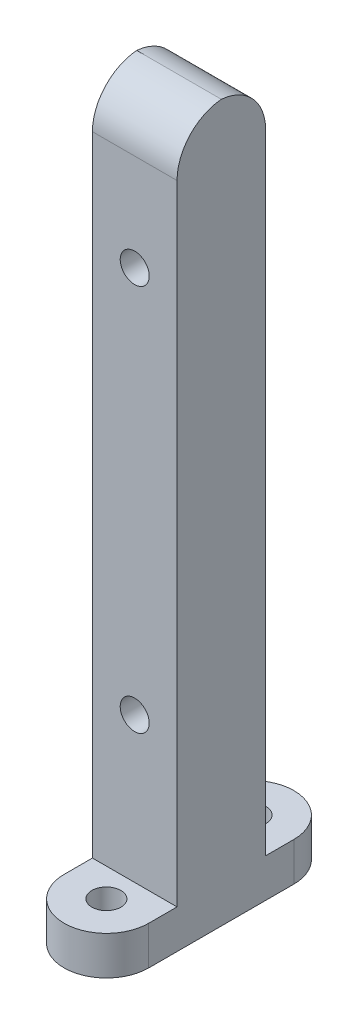
ISO-10303-21;
HEADER;
FILE_DESCRIPTION(('STEP AP214'),'2;1');
FILE_NAME('part.step','',(''),(''),'','','');
FILE_SCHEMA(('AUTOMOTIVE_DESIGN { 1 0 10303 214 1 1 1 1 }'));
ENDSEC;
DATA;
#1=APPLICATION_CONTEXT('core data for automotive mechanical design processes');
#2=APPLICATION_PROTOCOL_DEFINITION('international standard','automotive_design',2000,#1);
#3=PRODUCT_CONTEXT('',#1,'mechanical');
#4=PRODUCT('Part','Part','',(#3));
#5=PRODUCT_RELATED_PRODUCT_CATEGORY('part','',(#4));
#6=PRODUCT_DEFINITION_FORMATION('','',#4);
#7=PRODUCT_DEFINITION_CONTEXT('part definition',#1,'design');
#8=PRODUCT_DEFINITION('design','',#6,#7);
#9=PRODUCT_DEFINITION_SHAPE('','',#8);
#10=(LENGTH_UNIT() NAMED_UNIT(*) SI_UNIT(.MILLI.,.METRE.));
#11=(NAMED_UNIT(*) PLANE_ANGLE_UNIT() SI_UNIT($,.RADIAN.));
#12=(NAMED_UNIT(*) SI_UNIT($,.STERADIAN.) SOLID_ANGLE_UNIT());
#13=UNCERTAINTY_MEASURE_WITH_UNIT(LENGTH_MEASURE(1.E-05),#10,'distance_accuracy_value','');
#14=(GEOMETRIC_REPRESENTATION_CONTEXT(3) GLOBAL_UNCERTAINTY_ASSIGNED_CONTEXT((#13)) GLOBAL_UNIT_ASSIGNED_CONTEXT((#10,
#11,#12)) REPRESENTATION_CONTEXT('',''));
#15=CARTESIAN_POINT('',(0.,0.,0.));
#16=DIRECTION('',(0.,0.,1.));
#17=DIRECTION('',(1.,0.,0.));
#18=AXIS2_PLACEMENT_3D('',#15,#16,#17);
#19=CARTESIAN_POINT('',(0.,4.,0.));
#20=DIRECTION('',(0.,1.,0.));
#21=DIRECTION('',(0.,0.,1.));
#22=AXIS2_PLACEMENT_3D('',#19,#20,#21);
#23=PLANE('',#22);
#24=CARTESIAN_POINT('',(0.,4.,0.));
#25=DIRECTION('',(0.,1.,0.));
#26=DIRECTION('',(0.,0.,1.));
#27=AXIS2_PLACEMENT_3D('',#24,#25,#26);
#28=CIRCLE('',#27,1.5);
#29=CARTESIAN_POINT('',(0.,4.,1.5));
#30=VERTEX_POINT('',#29);
#31=EDGE_CURVE('E226',#30,#30,#28,.T.);
#32=ORIENTED_EDGE('',*,*,#31,.F.);
#33=EDGE_LOOP('',(#32));
#34=FACE_BOUND('',#33,.T.);
#35=DIRECTION('',(0.,0.,1.));
#36=VECTOR('',#35,1.);
#37=CARTESIAN_POINT('',(-4.37226155992608,4.,0.));
#38=LINE('',#37,#36);
#39=CARTESIAN_POINT('',(-4.37226155992608,4.,0.));
#40=VERTEX_POINT('',#39);
#41=CARTESIAN_POINT('',(-4.37226155992608,4.,2.92434167593318));
#42=VERTEX_POINT('',#41);
#43=EDGE_CURVE('E171',#40,#42,#38,.T.);
#44=ORIENTED_EDGE('',*,*,#43,.T.);
#45=DIRECTION('',(1.,0.,0.));
#46=VECTOR('',#45,1.);
#47=CARTESIAN_POINT('',(-4.37226155992608,4.,2.92434167593318));
#48=LINE('',#47,#46);
#49=CARTESIAN_POINT('',(4.37226155992608,4.,2.92434167593318));
#50=VERTEX_POINT('',#49);
#51=EDGE_CURVE('E159',#42,#50,#48,.T.);
#52=ORIENTED_EDGE('',*,*,#51,.T.);
#53=DIRECTION('',(0.,0.,1.));
#54=VECTOR('',#53,1.);
#55=CARTESIAN_POINT('',(4.37226155992608,4.,0.));
#56=LINE('',#55,#54);
#57=CARTESIAN_POINT('',(4.37226155992608,4.,0.));
#58=VERTEX_POINT('',#57);
#59=EDGE_CURVE('E167',#58,#50,#56,.T.);
#60=ORIENTED_EDGE('',*,*,#59,.F.);
#61=CARTESIAN_POINT('',(0.,4.,0.));
#62=DIRECTION('',(0.,1.,0.));
#63=DIRECTION('',(0.,0.,1.));
#64=AXIS2_PLACEMENT_3D('',#61,#62,#63);
#65=CIRCLE('',#64,4.37226155992608);
#66=EDGE_CURVE('E187',#58,#40,#65,.T.);
#67=ORIENTED_EDGE('',*,*,#66,.T.);
#68=EDGE_LOOP('',(#44,#52,#60,#67));
#69=FACE_BOUND('',#68,.T.);
#70=ADVANCED_FACE('F71',(#34,#69),#23,.T.);
#71=DIRECTION('',(1.,0.,0.));
#72=VECTOR('',#71,1.);
#73=CARTESIAN_POINT('',(-4.37226155992608,4.,12.0756583240668));
#74=LINE('',#73,#72);
#75=CARTESIAN_POINT('',(-4.37226155992608,4.,12.0756583240668));
#76=VERTEX_POINT('',#75);
#77=CARTESIAN_POINT('',(4.37226155992608,4.,12.0756583240668));
#78=VERTEX_POINT('',#77);
#79=EDGE_CURVE('E154',#76,#78,#74,.T.);
#80=ORIENTED_EDGE('',*,*,#79,.F.);
#81=CARTESIAN_POINT('',(-4.37226155992608,4.,15.));
#82=VERTEX_POINT('',#81);
#83=EDGE_CURVE('E237',#76,#82,#38,.T.);
#84=ORIENTED_EDGE('',*,*,#83,.T.);
#85=CARTESIAN_POINT('',(0.,4.,15.));
#86=DIRECTION('',(0.,1.,0.));
#87=DIRECTION('',(0.,0.,1.));
#88=AXIS2_PLACEMENT_3D('',#85,#86,#87);
#89=CIRCLE('',#88,4.37226155992608);
#90=CARTESIAN_POINT('',(4.37226155992608,4.,15.));
#91=VERTEX_POINT('',#90);
#92=EDGE_CURVE('E165',#82,#91,#89,.T.);
#93=ORIENTED_EDGE('',*,*,#92,.T.);
#94=EDGE_CURVE('E146',#78,#91,#56,.T.);
#95=ORIENTED_EDGE('',*,*,#94,.F.);
#96=EDGE_LOOP('',(#80,#84,#93,#95));
#97=FACE_BOUND('',#96,.T.);
#98=CARTESIAN_POINT('',(0.,4.,15.));
#99=DIRECTION('',(0.,1.,0.));
#100=DIRECTION('',(0.,0.,1.));
#101=AXIS2_PLACEMENT_3D('',#98,#99,#100);
#102=CIRCLE('',#101,1.5);
#103=CARTESIAN_POINT('',(0.,4.,16.5));
#104=VERTEX_POINT('',#103);
#105=EDGE_CURVE('E179',#104,#104,#102,.T.);
#106=ORIENTED_EDGE('',*,*,#105,.F.);
#107=EDGE_LOOP('',(#106));
#108=FACE_BOUND('',#107,.T.);
#109=ADVANCED_FACE('F162',(#97,#108),#23,.T.);
#110=CARTESIAN_POINT('',(0.,0.,0.));
#111=DIRECTION('',(0.,1.,0.));
#112=DIRECTION('',(0.,0.,1.));
#113=AXIS2_PLACEMENT_3D('',#110,#111,#112);
#114=PLANE('',#113);
#115=CARTESIAN_POINT('',(0.,0.,0.));
#116=DIRECTION('',(0.,1.,0.));
#117=DIRECTION('',(0.,0.,1.));
#118=AXIS2_PLACEMENT_3D('',#115,#116,#117);
#119=CIRCLE('',#118,4.37226155992608);
#120=CARTESIAN_POINT('',(4.37226155992608,0.,0.));
#121=VERTEX_POINT('',#120);
#122=CARTESIAN_POINT('',(-4.37226155992608,0.,0.));
#123=VERTEX_POINT('',#122);
#124=EDGE_CURVE('E175',#121,#123,#119,.T.);
#125=ORIENTED_EDGE('',*,*,#124,.F.);
#126=DIRECTION('',(0.,0.,1.));
#127=VECTOR('',#126,1.);
#128=CARTESIAN_POINT('',(4.37226155992608,0.,0.));
#129=LINE('',#128,#127);
#130=CARTESIAN_POINT('',(4.37226155992608,0.,15.));
#131=VERTEX_POINT('',#130);
#132=EDGE_CURVE('E184',#121,#131,#129,.T.);
#133=ORIENTED_EDGE('',*,*,#132,.T.);
#134=CARTESIAN_POINT('',(0.,0.,15.));
#135=DIRECTION('',(0.,1.,0.));
#136=DIRECTION('',(0.,0.,1.));
#137=AXIS2_PLACEMENT_3D('',#134,#135,#136);
#138=CIRCLE('',#137,4.37226155992608);
#139=CARTESIAN_POINT('',(-4.37226155992608,0.,15.));
#140=VERTEX_POINT('',#139);
#141=EDGE_CURVE('E181',#140,#131,#138,.T.);
#142=ORIENTED_EDGE('',*,*,#141,.F.);
#143=DIRECTION('',(0.,0.,1.));
#144=VECTOR('',#143,1.);
#145=CARTESIAN_POINT('',(-4.37226155992608,0.,0.));
#146=LINE('',#145,#144);
#147=EDGE_CURVE('E178',#123,#140,#146,.T.);
#148=ORIENTED_EDGE('',*,*,#147,.F.);
#149=EDGE_LOOP('',(#125,#133,#142,#148));
#150=FACE_BOUND('',#149,.T.);
#151=CARTESIAN_POINT('',(0.,0.,15.));
#152=DIRECTION('',(0.,1.,0.));
#153=DIRECTION('',(0.,0.,1.));
#154=AXIS2_PLACEMENT_3D('',#151,#152,#153);
#155=CIRCLE('',#154,1.5);
#156=CARTESIAN_POINT('',(0.,0.,16.5));
#157=VERTEX_POINT('',#156);
#158=EDGE_CURVE('E229',#157,#157,#155,.T.);
#159=ORIENTED_EDGE('',*,*,#158,.T.);
#160=EDGE_LOOP('',(#159));
#161=FACE_BOUND('',#160,.T.);
#162=CARTESIAN_POINT('',(0.,0.,0.));
#163=DIRECTION('',(0.,1.,0.));
#164=DIRECTION('',(0.,0.,1.));
#165=AXIS2_PLACEMENT_3D('',#162,#163,#164);
#166=CIRCLE('',#165,1.5);
#167=CARTESIAN_POINT('',(0.,0.,1.5));
#168=VERTEX_POINT('',#167);
#169=EDGE_CURVE('E150',#168,#168,#166,.T.);
#170=ORIENTED_EDGE('',*,*,#169,.T.);
#171=EDGE_LOOP('',(#170));
#172=FACE_BOUND('',#171,.T.);
#173=ADVANCED_FACE('F249',(#150,#161,#172),#114,.F.);
#174=CARTESIAN_POINT('',(0.,4.,0.));
#175=DIRECTION('',(0.,-1.,0.));
#176=DIRECTION('',(0.,0.,-1.));
#177=AXIS2_PLACEMENT_3D('',#174,#175,#176);
#178=CYLINDRICAL_SURFACE('',#177,4.37226155992608);
#179=ORIENTED_EDGE('',*,*,#124,.T.);
#180=DIRECTION('',(0.,-1.,0.));
#181=VECTOR('',#180,1.);
#182=CARTESIAN_POINT('',(-4.37226155992608,4.,0.));
#183=LINE('',#182,#181);
#184=EDGE_CURVE('E194',#40,#123,#183,.T.);
#185=ORIENTED_EDGE('',*,*,#184,.F.);
#186=ORIENTED_EDGE('',*,*,#66,.F.);
#187=DIRECTION('',(0.,-1.,0.));
#188=VECTOR('',#187,1.);
#189=CARTESIAN_POINT('',(4.37226155992608,4.,0.));
#190=LINE('',#189,#188);
#191=EDGE_CURVE('E170',#58,#121,#190,.T.);
#192=ORIENTED_EDGE('',*,*,#191,.T.);
#193=EDGE_LOOP('',(#179,#185,#186,#192));
#194=FACE_BOUND('',#193,.T.);
#195=ADVANCED_FACE('F253',(#194),#178,.T.);
#196=CARTESIAN_POINT('',(-4.37226155992608,4.,0.));
#197=DIRECTION('',(1.,0.,0.));
#198=DIRECTION('',(0.,0.,-1.));
#199=AXIS2_PLACEMENT_3D('',#196,#197,#198);
#200=PLANE('',#199);
#201=CARTESIAN_POINT('',(-4.37226155992608,69.,7.07565832406681));
#202=DIRECTION('',(1.,0.,0.));
#203=DIRECTION('',(0.,0.,-1.));
#204=AXIS2_PLACEMENT_3D('',#201,#202,#203);
#205=CIRCLE('',#204,5.);
#206=CARTESIAN_POINT('',(-4.37226155992608,69.,12.0756583240668));
#207=VERTEX_POINT('',#206);
#208=CARTESIAN_POINT('',(-4.37226155992608,73.981960873197,7.5));
#209=VERTEX_POINT('',#208);
#210=EDGE_CURVE('E88',#207,#209,#205,.F.);
#211=ORIENTED_EDGE('',*,*,#210,.T.);
#212=CARTESIAN_POINT('',(-4.37226155992608,69.,7.92434167593318));
#213=DIRECTION('',(1.,0.,0.));
#214=DIRECTION('',(0.,0.,-1.));
#215=AXIS2_PLACEMENT_3D('',#212,#213,#214);
#216=CIRCLE('',#215,5.);
#217=CARTESIAN_POINT('',(-4.37226155992608,69.,2.92434167593318));
#218=VERTEX_POINT('',#217);
#219=EDGE_CURVE('E80',#209,#218,#216,.F.);
#220=ORIENTED_EDGE('',*,*,#219,.T.);
#221=DIRECTION('',(0.,-1.,0.));
#222=VECTOR('',#221,1.);
#223=CARTESIAN_POINT('',(-4.37226155992608,74.,2.92434167593318));
#224=LINE('',#223,#222);
#225=EDGE_CURVE('E223',#218,#42,#224,.T.);
#226=ORIENTED_EDGE('',*,*,#225,.T.);
#227=ORIENTED_EDGE('',*,*,#43,.F.);
#228=ORIENTED_EDGE('',*,*,#184,.T.);
#229=ORIENTED_EDGE('',*,*,#147,.T.);
#230=DIRECTION('',(0.,-1.,0.));
#231=VECTOR('',#230,1.);
#232=CARTESIAN_POINT('',(-4.37226155992608,4.,15.));
#233=LINE('',#232,#231);
#234=EDGE_CURVE('E191',#82,#140,#233,.T.);
#235=ORIENTED_EDGE('',*,*,#234,.F.);
#236=ORIENTED_EDGE('',*,*,#83,.F.);
#237=DIRECTION('',(0.,-1.,0.));
#238=VECTOR('',#237,1.);
#239=CARTESIAN_POINT('',(-4.37226155992608,74.,12.0756583240668));
#240=LINE('',#239,#238);
#241=EDGE_CURVE('E156',#207,#76,#240,.T.);
#242=ORIENTED_EDGE('',*,*,#241,.F.);
#243=EDGE_LOOP('',(#211,#220,#226,#227,#228,#229,#235,#236,#242));
#244=FACE_BOUND('',#243,.T.);
#245=ADVANCED_FACE('F241',(#244),#200,.F.);
#246=CARTESIAN_POINT('',(0.,4.,15.));
#247=DIRECTION('',(0.,-1.,0.));
#248=DIRECTION('',(0.,0.,-1.));
#249=AXIS2_PLACEMENT_3D('',#246,#247,#248);
#250=CYLINDRICAL_SURFACE('',#249,4.37226155992608);
#251=ORIENTED_EDGE('',*,*,#141,.T.);
#252=DIRECTION('',(0.,-1.,0.));
#253=VECTOR('',#252,1.);
#254=CARTESIAN_POINT('',(4.37226155992608,4.,15.));
#255=LINE('',#254,#253);
#256=EDGE_CURVE('E189',#91,#131,#255,.T.);
#257=ORIENTED_EDGE('',*,*,#256,.F.);
#258=ORIENTED_EDGE('',*,*,#92,.F.);
#259=ORIENTED_EDGE('',*,*,#234,.T.);
#260=EDGE_LOOP('',(#251,#257,#258,#259));
#261=FACE_BOUND('',#260,.T.);
#262=ADVANCED_FACE('F244',(#261),#250,.T.);
#263=CARTESIAN_POINT('',(4.37226155992608,4.,0.));
#264=DIRECTION('',(1.,0.,0.));
#265=DIRECTION('',(0.,0.,-1.));
#266=AXIS2_PLACEMENT_3D('',#263,#264,#265);
#267=PLANE('',#266);
#268=DIRECTION('',(0.,-1.,0.));
#269=VECTOR('',#268,1.);
#270=CARTESIAN_POINT('',(4.37226155992608,74.,2.92434167593318));
#271=LINE('',#270,#269);
#272=CARTESIAN_POINT('',(4.37226155992608,69.,2.92434167593318));
#273=VERTEX_POINT('',#272);
#274=EDGE_CURVE('E151',#273,#50,#271,.T.);
#275=ORIENTED_EDGE('',*,*,#274,.F.);
#276=CARTESIAN_POINT('',(4.37226155992608,69.,7.92434167593318));
#277=DIRECTION('',(1.,0.,0.));
#278=DIRECTION('',(0.,0.,-1.));
#279=AXIS2_PLACEMENT_3D('',#276,#277,#278);
#280=CIRCLE('',#279,5.);
#281=CARTESIAN_POINT('',(4.37226155992608,73.981960873197,7.5));
#282=VERTEX_POINT('',#281);
#283=EDGE_CURVE('E201',#273,#282,#280,.T.);
#284=ORIENTED_EDGE('',*,*,#283,.T.);
#285=CARTESIAN_POINT('',(4.37226155992608,69.,7.07565832406681));
#286=DIRECTION('',(1.,0.,0.));
#287=DIRECTION('',(0.,0.,-1.));
#288=AXIS2_PLACEMENT_3D('',#285,#286,#287);
#289=CIRCLE('',#288,5.);
#290=CARTESIAN_POINT('',(4.37226155992608,69.,12.0756583240668));
#291=VERTEX_POINT('',#290);
#292=EDGE_CURVE('E149',#282,#291,#289,.T.);
#293=ORIENTED_EDGE('',*,*,#292,.T.);
#294=DIRECTION('',(0.,-1.,0.));
#295=VECTOR('',#294,1.);
#296=CARTESIAN_POINT('',(4.37226155992608,74.,12.0756583240668));
#297=LINE('',#296,#295);
#298=EDGE_CURVE('E141',#291,#78,#297,.T.);
#299=ORIENTED_EDGE('',*,*,#298,.T.);
#300=ORIENTED_EDGE('',*,*,#94,.T.);
#301=ORIENTED_EDGE('',*,*,#256,.T.);
#302=ORIENTED_EDGE('',*,*,#132,.F.);
#303=ORIENTED_EDGE('',*,*,#191,.F.);
#304=ORIENTED_EDGE('',*,*,#59,.T.);
#305=EDGE_LOOP('',(#275,#284,#293,#299,#300,#301,#302,#303,#304));
#306=FACE_BOUND('',#305,.T.);
#307=ADVANCED_FACE('F144',(#306),#267,.T.);
#308=CARTESIAN_POINT('',(0.,4.,15.));
#309=DIRECTION('',(0.,-1.,0.));
#310=DIRECTION('',(0.,0.,-1.));
#311=AXIS2_PLACEMENT_3D('',#308,#309,#310);
#312=CYLINDRICAL_SURFACE('',#311,1.5);
#313=ORIENTED_EDGE('',*,*,#105,.T.);
#314=EDGE_LOOP('',(#313));
#315=FACE_BOUND('',#314,.T.);
#316=ORIENTED_EDGE('',*,*,#158,.F.);
#317=EDGE_LOOP('',(#316));
#318=FACE_BOUND('',#317,.T.);
#319=ADVANCED_FACE('F281',(#315,#318),#312,.F.);
#320=CARTESIAN_POINT('',(0.,4.,0.));
#321=DIRECTION('',(0.,-1.,0.));
#322=DIRECTION('',(0.,0.,-1.));
#323=AXIS2_PLACEMENT_3D('',#320,#321,#322);
#324=CYLINDRICAL_SURFACE('',#323,1.5);
#325=ORIENTED_EDGE('',*,*,#31,.T.);
#326=EDGE_LOOP('',(#325));
#327=FACE_BOUND('',#326,.T.);
#328=ORIENTED_EDGE('',*,*,#169,.F.);
#329=EDGE_LOOP('',(#328));
#330=FACE_BOUND('',#329,.T.);
#331=ADVANCED_FACE('F315',(#327,#330),#324,.F.);
#332=CARTESIAN_POINT('',(-4.37226155992608,74.,12.0756583240668));
#333=DIRECTION('',(0.,0.,-1.));
#334=DIRECTION('',(-1.,0.,0.));
#335=AXIS2_PLACEMENT_3D('',#332,#333,#334);
#336=PLANE('',#335);
#337=CARTESIAN_POINT('',(0.,59.,12.0756583240668));
#338=DIRECTION('',(0.,0.,1.));
#339=DIRECTION('',(1.,0.,0.));
#340=AXIS2_PLACEMENT_3D('',#337,#338,#339);
#341=CIRCLE('',#340,1.5);
#342=CARTESIAN_POINT('',(1.5,59.,12.0756583240668));
#343=VERTEX_POINT('',#342);
#344=EDGE_CURVE('E208',#343,#343,#341,.T.);
#345=ORIENTED_EDGE('',*,*,#344,.F.);
#346=EDGE_LOOP('',(#345));
#347=FACE_BOUND('',#346,.T.);
#348=CARTESIAN_POINT('',(0.,19.,12.0756583240668));
#349=DIRECTION('',(0.,0.,1.));
#350=DIRECTION('',(-1.,0.,0.));
#351=AXIS2_PLACEMENT_3D('',#348,#349,#350);
#352=CIRCLE('',#351,1.5);
#353=CARTESIAN_POINT('',(-1.5,19.,12.0756583240668));
#354=VERTEX_POINT('',#353);
#355=EDGE_CURVE('E213',#354,#354,#352,.T.);
#356=ORIENTED_EDGE('',*,*,#355,.F.);
#357=EDGE_LOOP('',(#356));
#358=FACE_BOUND('',#357,.T.);
#359=ORIENTED_EDGE('',*,*,#298,.F.);
#360=DIRECTION('',(1.,0.,0.));
#361=VECTOR('',#360,1.);
#362=CARTESIAN_POINT('',(-4.37226155992608,69.,12.0756583240668));
#363=LINE('',#362,#361);
#364=EDGE_CURVE('E12',#291,#207,#363,.F.);
#365=ORIENTED_EDGE('',*,*,#364,.T.);
#366=ORIENTED_EDGE('',*,*,#241,.T.);
#367=ORIENTED_EDGE('',*,*,#79,.T.);
#368=EDGE_LOOP('',(#359,#365,#366,#367));
#369=FACE_BOUND('',#368,.T.);
#370=ADVANCED_FACE('F155',(#347,#358,#369),#336,.F.);
#371=CARTESIAN_POINT('',(-4.37226155992608,74.,2.92434167593318));
#372=DIRECTION('',(0.,0.,-1.));
#373=DIRECTION('',(-1.,0.,0.));
#374=AXIS2_PLACEMENT_3D('',#371,#372,#373);
#375=PLANE('',#374);
#376=CARTESIAN_POINT('',(0.,59.,2.92434167593318));
#377=DIRECTION('',(0.,0.,-1.));
#378=DIRECTION('',(-1.,0.,0.));
#379=AXIS2_PLACEMENT_3D('',#376,#377,#378);
#380=CIRCLE('',#379,1.5);
#381=CARTESIAN_POINT('',(-1.5,59.,2.92434167593318));
#382=VERTEX_POINT('',#381);
#383=EDGE_CURVE('E75',#382,#382,#380,.T.);
#384=ORIENTED_EDGE('',*,*,#383,.F.);
#385=EDGE_LOOP('',(#384));
#386=FACE_BOUND('',#385,.T.);
#387=CARTESIAN_POINT('',(0.,19.,2.92434167593318));
#388=DIRECTION('',(0.,0.,-1.));
#389=DIRECTION('',(-1.,0.,0.));
#390=AXIS2_PLACEMENT_3D('',#387,#388,#389);
#391=CIRCLE('',#390,1.5);
#392=CARTESIAN_POINT('',(-1.5,19.,2.92434167593318));
#393=VERTEX_POINT('',#392);
#394=EDGE_CURVE('E206',#393,#393,#391,.T.);
#395=ORIENTED_EDGE('',*,*,#394,.F.);
#396=EDGE_LOOP('',(#395));
#397=FACE_BOUND('',#396,.T.);
#398=ORIENTED_EDGE('',*,*,#225,.F.);
#399=DIRECTION('',(1.,0.,0.));
#400=VECTOR('',#399,1.);
#401=CARTESIAN_POINT('',(4.37226155992608,69.,2.92434167593318));
#402=LINE('',#401,#400);
#403=EDGE_CURVE('E197',#218,#273,#402,.T.);
#404=ORIENTED_EDGE('',*,*,#403,.T.);
#405=ORIENTED_EDGE('',*,*,#274,.T.);
#406=ORIENTED_EDGE('',*,*,#51,.F.);
#407=EDGE_LOOP('',(#398,#404,#405,#406));
#408=FACE_BOUND('',#407,.T.);
#409=ADVANCED_FACE('F258',(#386,#397,#408),#375,.T.);
#410=CARTESIAN_POINT('',(0.,69.,7.07565832406681));
#411=DIRECTION('',(1.,0.,0.));
#412=DIRECTION('',(0.,0.,-1.));
#413=AXIS2_PLACEMENT_3D('',#410,#411,#412);
#414=CYLINDRICAL_SURFACE('',#413,5.);
#415=DIRECTION('',(1.,0.,0.));
#416=VECTOR('',#415,1.);
#417=CARTESIAN_POINT('',(0.,73.981960873197,7.5));
#418=LINE('',#417,#416);
#419=EDGE_CURVE('E160',#209,#282,#418,.T.);
#420=ORIENTED_EDGE('',*,*,#419,.F.);
#421=ORIENTED_EDGE('',*,*,#210,.F.);
#422=ORIENTED_EDGE('',*,*,#364,.F.);
#423=ORIENTED_EDGE('',*,*,#292,.F.);
#424=EDGE_LOOP('',(#420,#421,#422,#423));
#425=FACE_BOUND('',#424,.T.);
#426=ADVANCED_FACE('F73',(#425),#414,.T.);
#427=CARTESIAN_POINT('',(-4.37226155992608,69.,7.92434167593318));
#428=DIRECTION('',(-1.,0.,0.));
#429=DIRECTION('',(0.,0.,1.));
#430=AXIS2_PLACEMENT_3D('',#427,#428,#429);
#431=CYLINDRICAL_SURFACE('',#430,5.);
#432=ORIENTED_EDGE('',*,*,#219,.F.);
#433=ORIENTED_EDGE('',*,*,#419,.T.);
#434=ORIENTED_EDGE('',*,*,#283,.F.);
#435=ORIENTED_EDGE('',*,*,#403,.F.);
#436=EDGE_LOOP('',(#432,#433,#434,#435));
#437=FACE_BOUND('',#436,.T.);
#438=ADVANCED_FACE('F262',(#437),#431,.T.);
#439=CARTESIAN_POINT('',(0.,19.,-42.9243416759332));
#440=DIRECTION('',(0.,0.,1.));
#441=DIRECTION('',(1.,0.,0.));
#442=AXIS2_PLACEMENT_3D('',#439,#440,#441);
#443=CYLINDRICAL_SURFACE('',#442,1.5);
#444=ORIENTED_EDGE('',*,*,#394,.T.);
#445=EDGE_LOOP('',(#444));
#446=FACE_BOUND('',#445,.T.);
#447=ORIENTED_EDGE('',*,*,#355,.T.);
#448=EDGE_LOOP('',(#447));
#449=FACE_BOUND('',#448,.T.);
#450=ADVANCED_FACE('F269',(#446,#449),#443,.F.);
#451=CARTESIAN_POINT('',(0.,59.,-42.9243416759332));
#452=DIRECTION('',(0.,0.,1.));
#453=DIRECTION('',(1.,0.,0.));
#454=AXIS2_PLACEMENT_3D('',#451,#452,#453);
#455=CYLINDRICAL_SURFACE('',#454,1.5);
#456=ORIENTED_EDGE('',*,*,#383,.T.);
#457=EDGE_LOOP('',(#456));
#458=FACE_BOUND('',#457,.T.);
#459=ORIENTED_EDGE('',*,*,#344,.T.);
#460=EDGE_LOOP('',(#459));
#461=FACE_BOUND('',#460,.T.);
#462=ADVANCED_FACE('F345',(#458,#461),#455,.F.);
#463=CLOSED_SHELL('',(#70,#109,#173,#195,#245,#262,#307,#319,#331,#370,#409,#426,#438,#450,#462));
#464=MANIFOLD_SOLID_BREP('B2',#463);
#465=ADVANCED_BREP_SHAPE_REPRESENTATION('',(#18,#464),#14);
#466=SHAPE_DEFINITION_REPRESENTATION(#9,#465);
ENDSEC;
END-ISO-10303-21;
